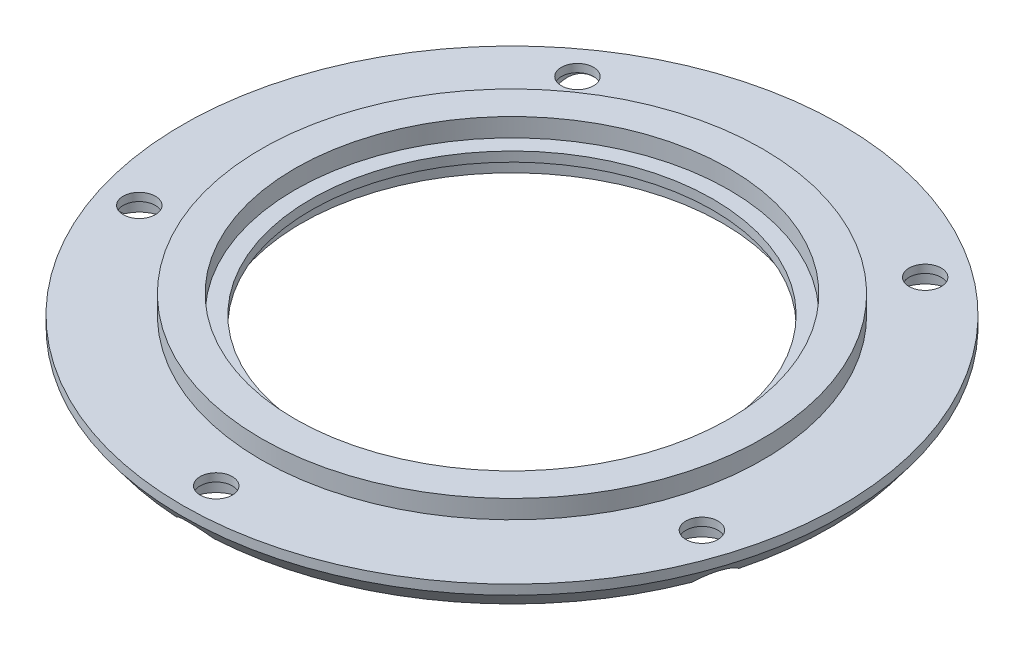
ISO-10303-21;
HEADER;
FILE_DESCRIPTION(('STEP AP214'),'2;1');
FILE_NAME('part.step','',(''),(''),'','','');
FILE_SCHEMA(('AUTOMOTIVE_DESIGN { 1 0 10303 214 1 1 1 1 }'));
ENDSEC;
DATA;
#1=APPLICATION_CONTEXT('core data for automotive mechanical design processes');
#2=APPLICATION_PROTOCOL_DEFINITION('international standard','automotive_design',2000,#1);
#3=PRODUCT_CONTEXT('',#1,'mechanical');
#4=PRODUCT('Part','Part','',(#3));
#5=PRODUCT_RELATED_PRODUCT_CATEGORY('part','',(#4));
#6=PRODUCT_DEFINITION_FORMATION('','',#4);
#7=PRODUCT_DEFINITION_CONTEXT('part definition',#1,'design');
#8=PRODUCT_DEFINITION('design','',#6,#7);
#9=PRODUCT_DEFINITION_SHAPE('','',#8);
#10=(LENGTH_UNIT() NAMED_UNIT(*) SI_UNIT(.MILLI.,.METRE.));
#11=(NAMED_UNIT(*) PLANE_ANGLE_UNIT() SI_UNIT($,.RADIAN.));
#12=(NAMED_UNIT(*) SI_UNIT($,.STERADIAN.) SOLID_ANGLE_UNIT());
#13=UNCERTAINTY_MEASURE_WITH_UNIT(LENGTH_MEASURE(1.E-05),#10,'distance_accuracy_value','');
#14=(GEOMETRIC_REPRESENTATION_CONTEXT(3) GLOBAL_UNCERTAINTY_ASSIGNED_CONTEXT((#13)) GLOBAL_UNIT_ASSIGNED_CONTEXT((#10,
#11,#12)) REPRESENTATION_CONTEXT('',''));
#15=CARTESIAN_POINT('',(0.,0.,0.));
#16=DIRECTION('',(0.,0.,1.));
#17=DIRECTION('',(1.,0.,0.));
#18=AXIS2_PLACEMENT_3D('',#15,#16,#17);
#19=CARTESIAN_POINT('',(-17.4994398998308,-1.6,5.68591269649923));
#20=DIRECTION('',(0.,1.,0.));
#21=DIRECTION('',(0.,0.,1.));
#22=AXIS2_PLACEMENT_3D('',#19,#20,#21);
#23=CYLINDRICAL_SURFACE('',#22,1.);
#24=CARTESIAN_POINT('',(-17.4994398998308,0.,5.68591269649923));
#25=DIRECTION('',(0.,1.,0.));
#26=DIRECTION('',(0.,0.,1.));
#27=AXIS2_PLACEMENT_3D('',#24,#25,#26);
#28=CIRCLE('',#27,1.);
#29=CARTESIAN_POINT('',(-17.4994398998308,0.,6.68591269649923));
#30=VERTEX_POINT('',#29);
#31=EDGE_CURVE('E121',#30,#30,#28,.T.);
#32=ORIENTED_EDGE('',*,*,#31,.T.);
#33=EDGE_LOOP('',(#32));
#34=FACE_BOUND('',#33,.T.);
#35=CARTESIAN_POINT('',(-17.4994398998308,-0.499999999999999,5.68591269649923));
#36=DIRECTION('',(0.,-1.,0.));
#37=DIRECTION('',(0.,0.,-1.));
#38=AXIS2_PLACEMENT_3D('',#35,#36,#37);
#39=CIRCLE('',#38,1.);
#40=CARTESIAN_POINT('',(-17.4994398998308,-0.499999999999999,4.68591269649923));
#41=VERTEX_POINT('',#40);
#42=EDGE_CURVE('E239',#41,#41,#39,.F.);
#43=ORIENTED_EDGE('',*,*,#42,.F.);
#44=EDGE_LOOP('',(#43));
#45=FACE_BOUND('',#44,.T.);
#46=ADVANCED_FACE('F35',(#34,#45),#23,.F.);
#47=CARTESIAN_POINT('',(-10.8152486421816,-1.6,-14.8859126964989));
#48=DIRECTION('',(0.,1.,0.));
#49=DIRECTION('',(0.,0.,1.));
#50=AXIS2_PLACEMENT_3D('',#47,#48,#49);
#51=CYLINDRICAL_SURFACE('',#50,0.999999999999999);
#52=CARTESIAN_POINT('',(-10.8152486421816,0.,-14.8859126964989));
#53=DIRECTION('',(0.,1.,0.));
#54=DIRECTION('',(0.,0.,1.));
#55=AXIS2_PLACEMENT_3D('',#52,#53,#54);
#56=CIRCLE('',#55,0.999999999999999);
#57=CARTESIAN_POINT('',(-10.8152486421816,0.,-13.8859126964989));
#58=VERTEX_POINT('',#57);
#59=EDGE_CURVE('E212',#58,#58,#56,.T.);
#60=ORIENTED_EDGE('',*,*,#59,.T.);
#61=EDGE_LOOP('',(#60));
#62=FACE_BOUND('',#61,.T.);
#63=CARTESIAN_POINT('',(-10.8152486421816,-0.499999999999999,-14.8859126964989));
#64=DIRECTION('',(0.,-1.,0.));
#65=DIRECTION('',(0.,0.,-1.));
#66=AXIS2_PLACEMENT_3D('',#63,#64,#65);
#67=CIRCLE('',#66,0.999999999999999);
#68=CARTESIAN_POINT('',(-10.8152486421816,-0.499999999999999,-15.8859126964989));
#69=VERTEX_POINT('',#68);
#70=EDGE_CURVE('E233',#69,#69,#67,.F.);
#71=ORIENTED_EDGE('',*,*,#70,.F.);
#72=EDGE_LOOP('',(#71));
#73=FACE_BOUND('',#72,.T.);
#74=ADVANCED_FACE('F146',(#62,#73),#51,.F.);
#75=CARTESIAN_POINT('',(10.8152486421814,-1.6,-14.8859126964991));
#76=DIRECTION('',(0.,1.,0.));
#77=DIRECTION('',(0.,0.,1.));
#78=AXIS2_PLACEMENT_3D('',#75,#76,#77);
#79=CYLINDRICAL_SURFACE('',#78,1.);
#80=CARTESIAN_POINT('',(10.8152486421814,0.,-14.8859126964991));
#81=DIRECTION('',(0.,1.,0.));
#82=DIRECTION('',(0.,0.,1.));
#83=AXIS2_PLACEMENT_3D('',#80,#81,#82);
#84=CIRCLE('',#83,1.);
#85=CARTESIAN_POINT('',(10.8152486421814,0.,-13.8859126964991));
#86=VERTEX_POINT('',#85);
#87=EDGE_CURVE('E209',#86,#86,#84,.T.);
#88=ORIENTED_EDGE('',*,*,#87,.T.);
#89=EDGE_LOOP('',(#88));
#90=FACE_BOUND('',#89,.T.);
#91=CARTESIAN_POINT('',(10.8152486421814,-0.499999999999999,-14.8859126964991));
#92=DIRECTION('',(0.,-1.,0.));
#93=DIRECTION('',(0.,0.,-1.));
#94=AXIS2_PLACEMENT_3D('',#91,#92,#93);
#95=CIRCLE('',#94,1.);
#96=CARTESIAN_POINT('',(10.8152486421814,-0.499999999999999,-15.8859126964991));
#97=VERTEX_POINT('',#96);
#98=EDGE_CURVE('E226',#97,#97,#95,.F.);
#99=ORIENTED_EDGE('',*,*,#98,.F.);
#100=EDGE_LOOP('',(#99));
#101=FACE_BOUND('',#100,.T.);
#102=ADVANCED_FACE('F150',(#90,#101),#79,.F.);
#103=CARTESIAN_POINT('',(17.4994398998308,-1.6,5.68591269649898));
#104=DIRECTION('',(0.,1.,0.));
#105=DIRECTION('',(0.,0.,1.));
#106=AXIS2_PLACEMENT_3D('',#103,#104,#105);
#107=CYLINDRICAL_SURFACE('',#106,1.);
#108=CARTESIAN_POINT('',(17.4994398998308,0.,5.68591269649898));
#109=DIRECTION('',(0.,1.,0.));
#110=DIRECTION('',(0.,0.,1.));
#111=AXIS2_PLACEMENT_3D('',#108,#109,#110);
#112=CIRCLE('',#111,1.);
#113=CARTESIAN_POINT('',(17.4994398998308,0.,6.68591269649898));
#114=VERTEX_POINT('',#113);
#115=EDGE_CURVE('E206',#114,#114,#112,.T.);
#116=ORIENTED_EDGE('',*,*,#115,.T.);
#117=EDGE_LOOP('',(#116));
#118=FACE_BOUND('',#117,.T.);
#119=CARTESIAN_POINT('',(17.4994398998308,-0.499999999999999,5.68591269649898));
#120=DIRECTION('',(0.,-1.,0.));
#121=DIRECTION('',(0.,0.,-1.));
#122=AXIS2_PLACEMENT_3D('',#119,#120,#121);
#123=CIRCLE('',#122,1.);
#124=CARTESIAN_POINT('',(17.4994398998308,-0.499999999999999,4.68591269649898));
#125=VERTEX_POINT('',#124);
#126=EDGE_CURVE('E130',#125,#125,#123,.F.);
#127=ORIENTED_EDGE('',*,*,#126,.F.);
#128=EDGE_LOOP('',(#127));
#129=FACE_BOUND('',#128,.T.);
#130=ADVANCED_FACE('F154',(#118,#129),#107,.F.);
#131=CARTESIAN_POINT('',(0.,-1.6,18.4));
#132=DIRECTION('',(0.,1.,0.));
#133=DIRECTION('',(0.,0.,1.));
#134=AXIS2_PLACEMENT_3D('',#131,#132,#133);
#135=CYLINDRICAL_SURFACE('',#134,1.);
#136=CARTESIAN_POINT('',(0.,0.,18.4));
#137=DIRECTION('',(0.,1.,0.));
#138=DIRECTION('',(0.,0.,1.));
#139=AXIS2_PLACEMENT_3D('',#136,#137,#138);
#140=CIRCLE('',#139,1.);
#141=CARTESIAN_POINT('',(0.,0.,19.4));
#142=VERTEX_POINT('',#141);
#143=EDGE_CURVE('E203',#142,#142,#140,.T.);
#144=ORIENTED_EDGE('',*,*,#143,.T.);
#145=EDGE_LOOP('',(#144));
#146=FACE_BOUND('',#145,.T.);
#147=CARTESIAN_POINT('',(0.,-0.499999999999999,18.4));
#148=DIRECTION('',(0.,-1.,0.));
#149=DIRECTION('',(0.,0.,-1.));
#150=AXIS2_PLACEMENT_3D('',#147,#148,#149);
#151=CIRCLE('',#150,1.);
#152=CARTESIAN_POINT('',(0.,-0.499999999999999,17.4));
#153=VERTEX_POINT('',#152);
#154=EDGE_CURVE('E118',#153,#153,#151,.F.);
#155=ORIENTED_EDGE('',*,*,#154,.F.);
#156=EDGE_LOOP('',(#155));
#157=FACE_BOUND('',#156,.T.);
#158=ADVANCED_FACE('F158',(#146,#157),#135,.F.);
#159=CARTESIAN_POINT('',(0.,0.,12.5));
#160=DIRECTION('',(0.,-1.,0.));
#161=DIRECTION('',(0.,0.,-1.));
#162=AXIS2_PLACEMENT_3D('',#159,#160,#161);
#163=PLANE('',#162);
#164=CARTESIAN_POINT('',(0.,0.,0.));
#165=DIRECTION('',(0.,-1.,0.));
#166=DIRECTION('',(0.,0.,-1.));
#167=AXIS2_PLACEMENT_3D('',#164,#165,#166);
#168=CIRCLE('',#167,13.5);
#169=CARTESIAN_POINT('',(0.,0.,-13.5));
#170=VERTEX_POINT('',#169);
#171=EDGE_CURVE('E200',#170,#170,#168,.T.);
#172=ORIENTED_EDGE('',*,*,#171,.F.);
#173=EDGE_LOOP('',(#172));
#174=FACE_BOUND('',#173,.T.);
#175=CARTESIAN_POINT('',(0.,0.,0.));
#176=DIRECTION('',(0.,-1.,0.));
#177=DIRECTION('',(0.,0.,-1.));
#178=AXIS2_PLACEMENT_3D('',#175,#176,#177);
#179=CIRCLE('',#178,12.5);
#180=CARTESIAN_POINT('',(0.,0.,-12.5));
#181=VERTEX_POINT('',#180);
#182=EDGE_CURVE('E114',#181,#181,#179,.T.);
#183=ORIENTED_EDGE('',*,*,#182,.T.);
#184=EDGE_LOOP('',(#183));
#185=FACE_BOUND('',#184,.T.);
#186=ADVANCED_FACE('F37',(#174,#185),#163,.F.);
#187=CARTESIAN_POINT('',(0.,-40.8786396240581,0.));
#188=DIRECTION('',(0.,-1.,0.));
#189=DIRECTION('',(0.,0.,-1.));
#190=AXIS2_PLACEMENT_3D('',#187,#188,#189);
#191=CYLINDRICAL_SURFACE('',#190,12.5);
#192=ORIENTED_EDGE('',*,*,#182,.F.);
#193=EDGE_LOOP('',(#192));
#194=FACE_BOUND('',#193,.T.);
#195=CARTESIAN_POINT('',(0.,-0.599999999999996,0.));
#196=DIRECTION('',(0.,-1.,0.));
#197=DIRECTION('',(0.,0.,-1.));
#198=AXIS2_PLACEMENT_3D('',#195,#196,#197);
#199=CIRCLE('',#198,12.5);
#200=CARTESIAN_POINT('',(0.,-0.599999999999996,-12.5));
#201=VERTEX_POINT('',#200);
#202=EDGE_CURVE('E111',#201,#201,#199,.T.);
#203=ORIENTED_EDGE('',*,*,#202,.T.);
#204=EDGE_LOOP('',(#203));
#205=FACE_BOUND('',#204,.T.);
#206=ADVANCED_FACE('F401',(#194,#205),#191,.F.);
#207=CARTESIAN_POINT('',(0.,-0.599999999999999,13.1));
#208=DIRECTION('',(0.,1.,0.));
#209=DIRECTION('',(0.,0.,1.));
#210=AXIS2_PLACEMENT_3D('',#207,#208,#209);
#211=PLANE('',#210);
#212=ORIENTED_EDGE('',*,*,#202,.F.);
#213=EDGE_LOOP('',(#212));
#214=FACE_BOUND('',#213,.T.);
#215=CARTESIAN_POINT('',(0.,-0.599999999999996,0.));
#216=DIRECTION('',(0.,-1.,0.));
#217=DIRECTION('',(0.,0.,-1.));
#218=AXIS2_PLACEMENT_3D('',#215,#216,#217);
#219=CIRCLE('',#218,13.1);
#220=CARTESIAN_POINT('',(0.,-0.599999999999996,-13.1));
#221=VERTEX_POINT('',#220);
#222=EDGE_CURVE('E108',#221,#221,#219,.T.);
#223=ORIENTED_EDGE('',*,*,#222,.T.);
#224=EDGE_LOOP('',(#223));
#225=FACE_BOUND('',#224,.T.);
#226=ADVANCED_FACE('F391',(#214,#225),#211,.F.);
#227=CARTESIAN_POINT('',(0.,-40.8786396240581,0.));
#228=DIRECTION('',(0.,-1.,0.));
#229=DIRECTION('',(0.,0.,-1.));
#230=AXIS2_PLACEMENT_3D('',#227,#228,#229);
#231=CYLINDRICAL_SURFACE('',#230,13.1);
#232=ORIENTED_EDGE('',*,*,#222,.F.);
#233=EDGE_LOOP('',(#232));
#234=FACE_BOUND('',#233,.T.);
#235=CARTESIAN_POINT('',(0.,-1.6,0.));
#236=DIRECTION('',(0.,-1.,0.));
#237=DIRECTION('',(0.,0.,-1.));
#238=AXIS2_PLACEMENT_3D('',#235,#236,#237);
#239=CIRCLE('',#238,13.1);
#240=CARTESIAN_POINT('',(0.,-1.6,-13.1));
#241=VERTEX_POINT('',#240);
#242=EDGE_CURVE('E99',#241,#241,#239,.T.);
#243=ORIENTED_EDGE('',*,*,#242,.T.);
#244=EDGE_LOOP('',(#243));
#245=FACE_BOUND('',#244,.T.);
#246=ADVANCED_FACE('F373',(#234,#245),#231,.F.);
#247=CARTESIAN_POINT('',(0.,-1.6,19.75));
#248=DIRECTION('',(0.,1.,0.));
#249=DIRECTION('',(0.,0.,1.));
#250=AXIS2_PLACEMENT_3D('',#247,#248,#249);
#251=PLANE('',#250);
#252=ORIENTED_EDGE('',*,*,#242,.F.);
#253=EDGE_LOOP('',(#252));
#254=FACE_BOUND('',#253,.T.);
#255=CARTESIAN_POINT('',(0.,-1.6,0.));
#256=DIRECTION('',(0.,-1.,0.));
#257=DIRECTION('',(0.,0.,-1.));
#258=AXIS2_PLACEMENT_3D('',#255,#256,#257);
#259=CIRCLE('',#258,19.75);
#260=CARTESIAN_POINT('',(-1.15318813031273,-1.6,19.7163043478261));
#261=VERTEX_POINT('',#260);
#262=CARTESIAN_POINT('',(-18.3949649972804,-1.6,7.18942019559509));
#263=VERTEX_POINT('',#262);
#264=EDGE_CURVE('E90',#261,#263,#259,.T.);
#265=ORIENTED_EDGE('',*,*,#264,.T.);
#266=CARTESIAN_POINT('',(-17.4994398998303,-1.6,5.68591269649829));
#267=DIRECTION('',(0.,-1.,0.));
#268=DIRECTION('',(0.,0.,-1.));
#269=AXIS2_PLACEMENT_3D('',#266,#267,#268);
#270=CIRCLE('',#269,1.75000000000094);
#271=CARTESIAN_POINT('',(-19.1076744572369,-1.6,4.99592602389763));
#272=VERTEX_POINT('',#271);
#273=EDGE_CURVE('E54',#272,#263,#270,.T.);
#274=ORIENTED_EDGE('',*,*,#273,.F.);
#275=CARTESIAN_POINT('',(-12.5219017204971,-1.6,-15.272998307543));
#276=VERTEX_POINT('',#275);
#277=EDGE_CURVE('E60',#272,#276,#259,.T.);
#278=ORIENTED_EDGE('',*,*,#277,.T.);
#279=CARTESIAN_POINT('',(-10.8152486421801,-1.6,-14.8859126964995));
#280=DIRECTION('',(0.,-1.,0.));
#281=DIRECTION('',(0.,0.,-1.));
#282=AXIS2_PLACEMENT_3D('',#279,#280,#281);
#283=CIRCLE('',#282,1.75000000000164);
#284=CARTESIAN_POINT('',(-10.6560041302246,-1.6,-16.6286522597785));
#285=VERTEX_POINT('',#284);
#286=EDGE_CURVE('E236',#285,#276,#283,.T.);
#287=ORIENTED_EDGE('',*,*,#286,.F.);
#288=CARTESIAN_POINT('',(10.6560041302267,-1.6,-16.6286522597772));
#289=VERTEX_POINT('',#288);
#290=EDGE_CURVE('E97',#285,#289,#259,.T.);
#291=ORIENTED_EDGE('',*,*,#290,.T.);
#292=CARTESIAN_POINT('',(10.8152486421829,-1.6,-14.8859126964986));
#293=DIRECTION('',(0.,-1.,0.));
#294=DIRECTION('',(0.,0.,-1.));
#295=AXIS2_PLACEMENT_3D('',#292,#293,#294);
#296=CIRCLE('',#295,1.75000000000132);
#297=CARTESIAN_POINT('',(12.5219017204999,-1.6,-15.2729983075407));
#298=VERTEX_POINT('',#297);
#299=EDGE_CURVE('E229',#298,#289,#296,.T.);
#300=ORIENTED_EDGE('',*,*,#299,.F.);
#301=CARTESIAN_POINT('',(19.1076744572368,-1.6,4.99592602389791));
#302=VERTEX_POINT('',#301);
#303=EDGE_CURVE('E101',#298,#302,#259,.T.);
#304=ORIENTED_EDGE('',*,*,#303,.T.);
#305=CARTESIAN_POINT('',(17.4994398998314,-1.6,5.68591269649978));
#306=DIRECTION('',(0.,-1.,0.));
#307=DIRECTION('',(0.,0.,-1.));
#308=AXIS2_PLACEMENT_3D('',#305,#306,#307);
#309=CIRCLE('',#308,1.75000000000035);
#310=CARTESIAN_POINT('',(18.3949649972796,-1.6,7.18942019559699));
#311=VERTEX_POINT('',#310);
#312=EDGE_CURVE('E222',#311,#302,#309,.T.);
#313=ORIENTED_EDGE('',*,*,#312,.F.);
#314=CARTESIAN_POINT('',(1.15318813031273,-1.6,19.7163043478261));
#315=VERTEX_POINT('',#314);
#316=EDGE_CURVE('E100',#311,#315,#259,.T.);
#317=ORIENTED_EDGE('',*,*,#316,.T.);
#318=CARTESIAN_POINT('',(0.,-1.6,18.4));
#319=DIRECTION('',(0.,-1.,0.));
#320=DIRECTION('',(0.,0.,-1.));
#321=AXIS2_PLACEMENT_3D('',#318,#319,#320);
#322=CIRCLE('',#321,1.75);
#323=EDGE_CURVE('E217',#261,#315,#322,.T.);
#324=ORIENTED_EDGE('',*,*,#323,.F.);
#325=EDGE_LOOP('',(#265,#274,#278,#287,#291,#300,#304,#313,#317,#324));
#326=FACE_BOUND('',#325,.T.);
#327=ADVANCED_FACE('F88',(#254,#326),#251,.F.);
#328=CARTESIAN_POINT('',(0.,-0.599999999999996,0.));
#329=DIRECTION('',(0.,1.,0.));
#330=DIRECTION('',(0.,0.,1.));
#331=AXIS2_PLACEMENT_3D('',#328,#329,#330);
#332=CONICAL_SURFACE('',#331,20.5,0.643501108793284);
#333=ORIENTED_EDGE('',*,*,#277,.F.);
#334=CARTESIAN_POINT('',(-19.107578115277,-1.6002,4.9957015114084));
#335=CARTESIAN_POINT('',(-19.1365636923052,-1.54000128969546,5.06329330237877));
#336=CARTESIAN_POINT('',(-19.1623432046582,-1.48220264219676,5.13508596947641));
#337=CARTESIAN_POINT('',(-19.2053259941403,-1.37367107805603,5.28739252826956));
#338=CARTESIAN_POINT('',(-19.222429848212,-1.32302467157268,5.36799519723536));
#339=CARTESIAN_POINT('',(-19.2425788022299,-1.24273863579547,5.51769407886391));
#340=CARTESIAN_POINT('',(-19.2479233929575,-1.21093706629558,5.58529033364524));
#341=CARTESIAN_POINT('',(-19.2503937266641,-1.15573286104441,5.7237771701638));
#342=CARTESIAN_POINT('',(-19.2475498932639,-1.1322994977202,5.79465459710565));
#343=CARTESIAN_POINT('',(-19.2325870674571,-1.09528898712679,5.93890126031064));
#344=CARTESIAN_POINT('',(-19.2203687500943,-1.08182044107502,6.012289087038));
#345=CARTESIAN_POINT('',(-19.1862028695232,-1.06653425965233,6.15805773253485));
#346=CARTESIAN_POINT('',(-19.1642567959591,-1.06471484106959,6.2304387037379));
#347=CARTESIAN_POINT('',(-19.1153832689739,-1.07229848429406,6.36070201241958));
#348=CARTESIAN_POINT('',(-19.089670846923,-1.08008319078523,6.41914647294675));
#349=CARTESIAN_POINT('',(-19.0328405268675,-1.10361011237025,6.531579103256));
#350=CARTESIAN_POINT('',(-19.0017237440659,-1.11935068702888,6.58556818903158));
#351=CARTESIAN_POINT('',(-18.9268774537274,-1.16263267411352,6.70119115434259));
#352=CARTESIAN_POINT('',(-18.8819489715881,-1.1921525154834,6.76130155529781));
#353=CARTESIAN_POINT('',(-18.7876150869865,-1.25987473580657,6.87270105804037));
#354=CARTESIAN_POINT('',(-18.7381933116903,-1.2981097011657,6.92395575002192));
#355=CARTESIAN_POINT('',(-18.6400783730836,-1.37840357591948,7.01467958483102));
#356=CARTESIAN_POINT('',(-18.5915467496434,-1.42005224319126,7.0546983205709));
#357=CARTESIAN_POINT('',(-18.493647730956,-1.50737319625697,7.12733912572517));
#358=CARTESIAN_POINT('',(-18.444292695061,-1.55300339062303,7.16002800094101));
#359=CARTESIAN_POINT('',(-18.3947550898674,-1.6002,7.18954520163113));
#360=B_SPLINE_CURVE_WITH_KNOTS('',3,(#334,#335,#336,#337,#338,#339,#340,#341,#342,#343,#344,
#345,#346,#347,#348,#349,#350,#351,#352,#353,#354,#355,#356,#357,#358,#359),.UNSPECIFIED.,.F.,
.F.,(4,2,2,2,2,2,2,2,2,2,2,2,4),(0.,0.285728652493824,0.574661693444567,0.798486899356478,
1.02148156983626,1.24687211735866,1.47222816197949,1.66428886634107,1.85630998549552,
2.09693024616022,2.33846540517584,2.56429685085106,2.78797782116164),.UNSPECIFIED.);
#361=EDGE_CURVE('E11',#272,#263,#360,.T.);
#362=ORIENTED_EDGE('',*,*,#361,.T.);
#363=ORIENTED_EDGE('',*,*,#264,.F.);
#364=CARTESIAN_POINT('',(-1.15337188307572,-1.6002,19.7161433430027));
#365=CARTESIAN_POINT('',(-1.09804530571879,-1.54000128969549,19.764597277004));
#366=CARTESIAN_POINT('',(-1.03773272927719,-1.48220264219682,19.8113002044189));
#367=CARTESIAN_POINT('',(-0.906162996478146,-1.37367107805615,19.8992445814662));
#368=CARTESIAN_POINT('',(-0.834790684504951,-1.32302467157282,19.9404189078373));
#369=CARTESIAN_POINT('',(-0.698644956860483,-1.24273863579564,20.0058412003146));
#370=CARTESIAN_POINT('',(-0.636008667636403,-1.21093706629577,20.0318125996365));
#371=CARTESIAN_POINT('',(-0.505063234441509,-1.15573286104463,20.076956812587));
#372=CARTESIAN_POINT('',(-0.436776002840429,-1.13229949772043,20.0961544957431));
#373=CARTESIAN_POINT('',(-0.294965506387403,-1.09528898712703,20.1264986730696));
#374=CARTESIAN_POINT('',(-0.221393867853892,-1.08182044107527,20.1375564483625));
#375=CARTESIAN_POINT('',(-0.0722018099584037,-1.06653425965258,20.1501077537159));
#376=CARTESIAN_POINT('',(0.00341829405109275,-1.06471484106984,20.1516027476168));
#377=CARTESIAN_POINT('',(0.142408813020364,-1.07229848429431,20.1453748374294));
#378=CARTESIAN_POINT('',(0.205938373426311,-1.08008319078548,20.1389812024181));
#379=CARTESIAN_POINT('',(0.330429693818976,-1.10361011237048,20.1196759496941));
#380=CARTESIAN_POINT('',(0.391391980350599,-1.11935068702911,20.1067656756599));
#381=CARTESIAN_POINT('',(0.52448473062346,-1.16263267411372,20.071312084734));
#382=CARTESIAN_POINT('',(0.595536783661509,-1.19215251548358,20.0471576944621));
#383=CARTESIAN_POINT('',(0.730634780144068,-1.25987473580671,19.9918651783167));
#384=CARTESIAN_POINT('',(0.794653057402485,-1.29810970116582,19.9607008477382));
#385=CARTESIAN_POINT('',(0.911255735112434,-1.37840357591956,19.8954232027813));
#386=CARTESIAN_POINT('',(0.964312910919347,-1.42005224319133,19.8616333554991));
#387=CARTESIAN_POINT('',(1.06365088251724,-1.50737319625701,19.7909730991153));
#388=CARTESIAN_POINT('',(1.10999139515115,-1.55300339062306,19.7541350885841));
#389=CARTESIAN_POINT('',(1.15337188307572,-1.6002,19.7161433430027));
#390=B_SPLINE_CURVE_WITH_KNOTS('',3,(#364,#365,#366,#367,#368,#369,#370,#371,#372,#373,#374,
#375,#376,#377,#378,#379,#380,#381,#382,#383,#384,#385,#386,#387,#388,#389),.UNSPECIFIED.,.F.,
.F.,(4,2,2,2,2,2,2,2,2,2,2,2,4),(0.,0.285728652493678,0.574661693444272,0.798486899356062,
1.02148156983573,1.246872117358,1.4722281619787,1.66428886634018,1.85630998549453,
2.09693024615909,2.33846540517457,2.5642968508497,2.78797782116019),.UNSPECIFIED.);
#391=EDGE_CURVE('E117',#261,#315,#390,.T.);
#392=ORIENTED_EDGE('',*,*,#391,.T.);
#393=ORIENTED_EDGE('',*,*,#316,.F.);
#394=CARTESIAN_POINT('',(18.3947550898667,-1.6002,7.18954520163303));
#395=CARTESIAN_POINT('',(18.4579343721827,-1.54000128969535,7.15189958876415));
#396=CARTESIAN_POINT('',(18.5209891067258,-1.48220264219655,7.10897091818309));
#397=CARTESIAN_POINT('',(18.6452864629687,-1.37367107805561,7.01101697352466));
#398=CARTESIAN_POINT('',(18.7065008316956,-1.32302467157215,6.95586143772009));
#399=CARTESIAN_POINT('',(18.810792472821,-1.24273863579478,6.84659575646449));
#400=CARTESIAN_POINT('',(18.8548484192183,-1.21093706629484,6.79505070919957));
#401=CARTESIAN_POINT('',(18.938247481311,-1.15573286104358,6.68446453067988));
#402=CARTESIAN_POINT('',(18.977607478038,-1.13229949771931,6.62545192443376));
#403=CARTESIAN_POINT('',(19.0502883590008,-1.09528898712579,6.49995899417724));
#404=CARTESIAN_POINT('',(19.0835398148598,-1.08182044107396,6.43340524842093));
#405=CARTESIAN_POINT('',(19.1415796969198,-1.06653425965116,6.29539373623566));
#406=CARTESIAN_POINT('',(19.1663694178664,-1.06471484106838,6.22393672207634));
#407=CARTESIAN_POINT('',(19.2033967557184,-1.07229848429277,6.08982435321994));
#408=CARTESIAN_POINT('',(19.2169477612887,-1.0800831907839,6.02742840894417));
#409=CARTESIAN_POINT('',(19.2370573085404,-1.10361011236885,5.90306447629004));
#410=CARTESIAN_POINT('',(19.2436172908472,-1.11935068702745,5.84109640235725));
#411=CARTESIAN_POINT('',(19.2510268438336,-1.162632674112,5.70356191283088));
#412=CARTESIAN_POINT('',(19.2500109454424,-1.19215251548182,5.62852327771011));
#413=CARTESIAN_POINT('',(19.2391722144792,-1.25987473580486,5.48295112066629));
#414=CARTESIAN_POINT('',(19.22931591043,-1.29810970116393,5.4124358131506));
#415=CARTESIAN_POINT('',(19.2032653898273,-1.37840357591788,5.28136817505216));
#416=CARTESIAN_POINT('',(19.1875249043828,-1.42005224318995,5.22046616521681));
#417=CARTESIAN_POINT('',(19.1510201285161,-1.50737319625628,5.10415491996279));
#418=CARTESIAN_POINT('',(19.1303051044848,-1.55300339062268,5.04869890216037));
#419=CARTESIAN_POINT('',(19.1075781152769,-1.6002,4.99570151140868));
#420=B_SPLINE_CURVE_WITH_KNOTS('',3,(#394,#395,#396,#397,#398,#399,#400,#401,#402,#403,#404,
#405,#406,#407,#408,#409,#410,#411,#412,#413,#414,#415,#416,#417,#418,#419),.UNSPECIFIED.,.F.,
.F.,(4,2,2,2,2,2,2,2,2,2,2,2,4),(0.,0.285728652494136,0.574661693445203,0.798486899357153,
1.02148156983697,1.24687211735941,1.47222816198028,1.66428886634184,1.85630998549627,
2.09693024616076,2.33846540517616,2.56429685085293,2.78797782116503),.UNSPECIFIED.);
#421=EDGE_CURVE('E129',#311,#302,#420,.T.);
#422=ORIENTED_EDGE('',*,*,#421,.T.);
#423=ORIENTED_EDGE('',*,*,#303,.F.);
#424=CARTESIAN_POINT('',(12.5219557433472,-1.6002,-15.2727600447383));
#425=CARTESIAN_POINT('',(12.5056761098464,-1.54000128969526,-15.3444802470201));
#426=CARTESIAN_POINT('',(12.484333502504,-1.48220264219636,-15.4177145519461));
#427=CARTESIAN_POINT('',(12.4295837605747,-1.37367107805525,-15.5661977961248));
#428=CARTESIAN_POINT('',(12.3960440090746,-1.32302467157171,-15.641460118291));
#429=CARTESIAN_POINT('',(12.324354060388,-1.24273863579423,-15.7744123155885));
#430=CARTESIAN_POINT('',(12.288945843444,-1.21093706629424,-15.832240306072));
#431=CARTESIAN_POINT('',(12.2095438652522,-1.15573286104289,-15.9457305360339));
#432=CARTESIAN_POINT('',(12.1655824494255,-1.13229949771859,-16.0014000156149));
#433=CARTESIAN_POINT('',(12.0686912077397,-1.095288987125,-16.1093030891879));
#434=CARTESIAN_POINT('',(12.0156700991024,-1.08182044107313,-16.161493341437));
#435=CARTESIAN_POINT('',(11.9023486610228,-1.06653425965028,-16.2593404521599));
#436=CARTESIAN_POINT('',(11.8420494471299,-1.06471484106746,-16.3049983095459));
#437=CARTESIAN_POINT('',(11.7259430814659,-1.07229848429182,-16.3816564016236));
#438=CARTESIAN_POINT('',(11.6707885030841,-1.08008319078295,-16.413825580935));
#439=CARTESIAN_POINT('',(11.5587255663912,-1.10361011236787,-16.4713814655659));
#440=CARTESIAN_POINT('',(11.5018175718907,-1.11935068702647,-16.4967695674396));
#441=CARTESIAN_POINT('',(11.3733041772048,-1.16263267411101,-16.5463169656665));
#442=CARTESIAN_POINT('',(11.3016242644318,-1.19215251548082,-16.5685390023687));
#443=CARTESIAN_POINT('',(11.159827563819,-1.25987473580386,-16.6032150270921));
#444=CARTESIAN_POINT('',(11.0897177556547,-1.29810970116293,-16.6156315532855));
#445=CARTESIAN_POINT('',(10.957014970787,-1.37840357591701,-16.6313581634986));
#446=CARTESIAN_POINT('',(10.8942296399753,-1.42005224318924,-16.6352078282776));
#447=CARTESIAN_POINT('',(10.7723304761389,-1.50737319625591,-16.6364318747341));
#448=CARTESIAN_POINT('',(10.7131873745754,-1.55300339062249,-16.6338675680852));
#449=CARTESIAN_POINT('',(10.6557608348579,-1.6002,-16.628630011303));
#450=B_SPLINE_CURVE_WITH_KNOTS('',3,(#424,#425,#426,#427,#428,#429,#430,#431,#432,#433,#434,
#435,#436,#437,#438,#439,#440,#441,#442,#443,#444,#445,#446,#447,#448,#449),.UNSPECIFIED.,.F.,
.F.,(4,2,2,2,2,2,2,2,2,2,2,2,4),(0.,0.285728652494479,0.574661693445891,0.798486899358022,
1.02148156983802,1.24687211736064,1.47222816198169,1.66428886634338,1.85630998549794,
2.0969302461625,2.33846540517799,2.56429685085562,2.78797782116856),.UNSPECIFIED.);
#451=EDGE_CURVE('E254',#298,#289,#450,.T.);
#452=ORIENTED_EDGE('',*,*,#451,.T.);
#453=ORIENTED_EDGE('',*,*,#290,.F.);
#454=CARTESIAN_POINT('',(-10.6557608348559,-1.60019999999999,-16.6286300113044));
#455=CARTESIAN_POINT('',(-10.7290014839999,-1.54000128969533,-16.6353099211256));
#456=CARTESIAN_POINT('',(-10.8052466752892,-1.48220264219651,-16.6376425401312));
#457=CARTESIAN_POINT('',(-10.9633812329197,-1.37367107805554,-16.631456287135));
#458=CARTESIAN_POINT('',(-11.045324308048,-1.32302467157206,-16.6228154245013));
#459=CARTESIAN_POINT('',(-11.1939227741134,-1.24273863579468,-16.5957187200544));
#460=CARTESIAN_POINT('',(-11.2598622020632,-1.21093706629473,-16.5799133364093));
#461=CARTESIAN_POINT('',(-11.3923343854525,-1.15573286104345,-16.539467977397));
#462=CARTESIAN_POINT('',(-11.4588640313541,-1.13229949771917,-16.5148610016679));
#463=CARTESIAN_POINT('',(-11.5914269928909,-1.09528898712565,-16.45605583837));
#464=CARTESIAN_POINT('',(-11.657447296009,-1.08182044107383,-16.421757442385));
#465=CARTESIAN_POINT('',(-11.7855236784562,-1.06653425965104,-16.3442187703273));
#466=CARTESIAN_POINT('',(-11.8475803630836,-1.06471484106826,-16.300979863886));
#467=CARTESIAN_POINT('',(-11.9563653812262,-1.07229848429267,-16.2142448014462));
#468=CARTESIAN_POINT('',(-12.0040037908717,-1.08008319078382,-16.171730503375));
#469=CARTESIAN_POINT('',(-12.0933720418787,-1.10361011236879,-16.0829380636752));
#470=CARTESIAN_POINT('',(-12.1351030990184,-1.11935068702741,-16.0366606996102));
#471=CARTESIAN_POINT('',(-12.2219382979304,-1.162632674112,-15.929748186242));
#472=CARTESIAN_POINT('',(-12.2652230219435,-1.19215251548185,-15.8684435251024));
#473=CARTESIAN_POINT('',(-12.3420194714516,-1.25987473580497,-15.7443023299322));
#474=CARTESIAN_POINT('',(-12.3754934117927,-1.29810970116408,-15.6814608576262));
#475=CARTESIAN_POINT('',(-12.4314577226399,-1.37840357591805,-15.5601127991672));
#476=CARTESIAN_POINT('',(-12.4545207056317,-1.42005224319009,-15.5015900130106));
#477=CARTESIAN_POINT('',(-12.4933537562158,-1.50737319625636,-15.3860352700706));
#478=CARTESIAN_POINT('',(-12.5091911791507,-1.55300339062272,-15.3289944236016));
#479=CARTESIAN_POINT('',(-12.5219557433444,-1.6002,-15.2727600447406));
#480=B_SPLINE_CURVE_WITH_KNOTS('',3,(#454,#455,#456,#457,#458,#459,#460,#461,#462,#463,#464,
#465,#466,#467,#468,#469,#470,#471,#472,#473,#474,#475,#476,#477,#478,#479),.UNSPECIFIED.,.F.,
.F.,(4,2,2,2,2,2,2,2,2,2,2,2,4),(0.,0.285728652494269,0.574661693445466,0.798486899357562,
1.02148156983753,1.24687211736011,1.47222816198113,1.66428886634283,1.8563099854974,
2.0969302461621,2.33846540517771,2.56429685085433,2.78797782116629),.UNSPECIFIED.);
#481=EDGE_CURVE('E48',#285,#276,#480,.T.);
#482=ORIENTED_EDGE('',*,*,#481,.T.);
#483=EDGE_LOOP('',(#333,#362,#363,#392,#393,#422,#423,#452,#453,#482));
#484=FACE_BOUND('',#483,.T.);
#485=CARTESIAN_POINT('',(0.,-0.599999999999996,0.));
#486=DIRECTION('',(0.,-1.,0.));
#487=DIRECTION('',(0.,0.,-1.));
#488=AXIS2_PLACEMENT_3D('',#485,#486,#487);
#489=CIRCLE('',#488,20.5);
#490=CARTESIAN_POINT('',(0.,-0.599999999999996,-20.5));
#491=VERTEX_POINT('',#490);
#492=EDGE_CURVE('E104',#491,#491,#489,.T.);
#493=ORIENTED_EDGE('',*,*,#492,.T.);
#494=EDGE_LOOP('',(#493));
#495=FACE_BOUND('',#494,.T.);
#496=ADVANCED_FACE('F94',(#484,#495),#332,.T.);
#497=CARTESIAN_POINT('',(0.,-40.8786396240581,0.));
#498=DIRECTION('',(0.,-1.,0.));
#499=DIRECTION('',(0.,0.,-1.));
#500=AXIS2_PLACEMENT_3D('',#497,#498,#499);
#501=CYLINDRICAL_SURFACE('',#500,20.5);
#502=ORIENTED_EDGE('',*,*,#492,.F.);
#503=EDGE_LOOP('',(#502));
#504=FACE_BOUND('',#503,.T.);
#505=CARTESIAN_POINT('',(0.,0.,0.));
#506=DIRECTION('',(0.,-1.,0.));
#507=DIRECTION('',(0.,0.,-1.));
#508=AXIS2_PLACEMENT_3D('',#505,#506,#507);
#509=CIRCLE('',#508,20.5);
#510=CARTESIAN_POINT('',(0.,0.,-20.5));
#511=VERTEX_POINT('',#510);
#512=EDGE_CURVE('E188',#511,#511,#509,.T.);
#513=ORIENTED_EDGE('',*,*,#512,.T.);
#514=EDGE_LOOP('',(#513));
#515=FACE_BOUND('',#514,.T.);
#516=ADVANCED_FACE('F176',(#504,#515),#501,.T.);
#517=CARTESIAN_POINT('',(0.,0.,15.6));
#518=DIRECTION('',(0.,-1.,0.));
#519=DIRECTION('',(0.,0.,-1.));
#520=AXIS2_PLACEMENT_3D('',#517,#518,#519);
#521=PLANE('',#520);
#522=ORIENTED_EDGE('',*,*,#31,.F.);
#523=EDGE_LOOP('',(#522));
#524=FACE_BOUND('',#523,.T.);
#525=ORIENTED_EDGE('',*,*,#59,.F.);
#526=EDGE_LOOP('',(#525));
#527=FACE_BOUND('',#526,.T.);
#528=ORIENTED_EDGE('',*,*,#87,.F.);
#529=EDGE_LOOP('',(#528));
#530=FACE_BOUND('',#529,.T.);
#531=ORIENTED_EDGE('',*,*,#115,.F.);
#532=EDGE_LOOP('',(#531));
#533=FACE_BOUND('',#532,.T.);
#534=ORIENTED_EDGE('',*,*,#143,.F.);
#535=EDGE_LOOP('',(#534));
#536=FACE_BOUND('',#535,.T.);
#537=ORIENTED_EDGE('',*,*,#512,.F.);
#538=EDGE_LOOP('',(#537));
#539=FACE_BOUND('',#538,.T.);
#540=CARTESIAN_POINT('',(0.,0.,0.));
#541=DIRECTION('',(0.,-1.,0.));
#542=DIRECTION('',(0.,0.,-1.));
#543=AXIS2_PLACEMENT_3D('',#540,#541,#542);
#544=CIRCLE('',#543,15.6);
#545=CARTESIAN_POINT('',(0.,0.,-15.6));
#546=VERTEX_POINT('',#545);
#547=EDGE_CURVE('E190',#546,#546,#544,.T.);
#548=ORIENTED_EDGE('',*,*,#547,.T.);
#549=EDGE_LOOP('',(#548));
#550=FACE_BOUND('',#549,.T.);
#551=ADVANCED_FACE('F173',(#524,#527,#530,#533,#536,#539,#550),#521,.F.);
#552=CARTESIAN_POINT('',(0.,-40.8786396240581,0.));
#553=DIRECTION('',(0.,-1.,0.));
#554=DIRECTION('',(0.,0.,-1.));
#555=AXIS2_PLACEMENT_3D('',#552,#553,#554);
#556=CYLINDRICAL_SURFACE('',#555,15.6);
#557=ORIENTED_EDGE('',*,*,#547,.F.);
#558=EDGE_LOOP('',(#557));
#559=FACE_BOUND('',#558,.T.);
#560=CARTESIAN_POINT('',(0.,1.15,0.));
#561=DIRECTION('',(0.,-1.,0.));
#562=DIRECTION('',(0.,0.,-1.));
#563=AXIS2_PLACEMENT_3D('',#560,#561,#562);
#564=CIRCLE('',#563,15.6);
#565=CARTESIAN_POINT('',(0.,1.15,-15.6));
#566=VERTEX_POINT('',#565);
#567=EDGE_CURVE('E192',#566,#566,#564,.T.);
#568=ORIENTED_EDGE('',*,*,#567,.T.);
#569=EDGE_LOOP('',(#568));
#570=FACE_BOUND('',#569,.T.);
#571=ADVANCED_FACE('F169',(#559,#570),#556,.T.);
#572=CARTESIAN_POINT('',(0.,1.15,13.5));
#573=DIRECTION('',(0.,-1.,0.));
#574=DIRECTION('',(0.,0.,-1.));
#575=AXIS2_PLACEMENT_3D('',#572,#573,#574);
#576=PLANE('',#575);
#577=ORIENTED_EDGE('',*,*,#567,.F.);
#578=EDGE_LOOP('',(#577));
#579=FACE_BOUND('',#578,.T.);
#580=CARTESIAN_POINT('',(0.,1.15,0.));
#581=DIRECTION('',(0.,-1.,0.));
#582=DIRECTION('',(0.,0.,-1.));
#583=AXIS2_PLACEMENT_3D('',#580,#581,#582);
#584=CIRCLE('',#583,13.5);
#585=CARTESIAN_POINT('',(0.,1.15,-13.5));
#586=VERTEX_POINT('',#585);
#587=EDGE_CURVE('E197',#586,#586,#584,.T.);
#588=ORIENTED_EDGE('',*,*,#587,.T.);
#589=EDGE_LOOP('',(#588));
#590=FACE_BOUND('',#589,.T.);
#591=ADVANCED_FACE('F165',(#579,#590),#576,.F.);
#592=CARTESIAN_POINT('',(0.,-40.8786396240581,0.));
#593=DIRECTION('',(0.,-1.,0.));
#594=DIRECTION('',(0.,0.,-1.));
#595=AXIS2_PLACEMENT_3D('',#592,#593,#594);
#596=CYLINDRICAL_SURFACE('',#595,13.5);
#597=ORIENTED_EDGE('',*,*,#587,.F.);
#598=EDGE_LOOP('',(#597));
#599=FACE_BOUND('',#598,.T.);
#600=ORIENTED_EDGE('',*,*,#171,.T.);
#601=EDGE_LOOP('',(#600));
#602=FACE_BOUND('',#601,.T.);
#603=ADVANCED_FACE('F141',(#599,#602),#596,.F.);
#604=CARTESIAN_POINT('',(0.,-0.499999999999999,18.4));
#605=DIRECTION('',(0.,-1.,0.));
#606=DIRECTION('',(0.,0.,-1.));
#607=AXIS2_PLACEMENT_3D('',#604,#605,#606);
#608=CYLINDRICAL_SURFACE('',#607,1.75);
#609=CARTESIAN_POINT('',(0.,-0.499999999999999,18.4));
#610=DIRECTION('',(0.,-1.,0.));
#611=DIRECTION('',(0.,0.,-1.));
#612=AXIS2_PLACEMENT_3D('',#609,#610,#611);
#613=CIRCLE('',#612,1.75);
#614=CARTESIAN_POINT('',(0.,-0.499999999999999,16.65));
#615=VERTEX_POINT('',#614);
#616=EDGE_CURVE('E122',#615,#615,#613,.T.);
#617=ORIENTED_EDGE('',*,*,#616,.F.);
#618=EDGE_LOOP('',(#617));
#619=FACE_BOUND('',#618,.T.);
#620=ORIENTED_EDGE('',*,*,#323,.T.);
#621=ORIENTED_EDGE('',*,*,#391,.F.);
#622=EDGE_LOOP('',(#620,#621));
#623=FACE_BOUND('',#622,.T.);
#624=ADVANCED_FACE('F135',(#619,#623),#608,.F.);
#625=CARTESIAN_POINT('',(0.,-0.499999999999999,18.4));
#626=DIRECTION('',(0.,-1.,0.));
#627=DIRECTION('',(0.,0.,-1.));
#628=AXIS2_PLACEMENT_3D('',#625,#626,#627);
#629=PLANE('',#628);
#630=ORIENTED_EDGE('',*,*,#616,.T.);
#631=EDGE_LOOP('',(#630));
#632=FACE_BOUND('',#631,.T.);
#633=ORIENTED_EDGE('',*,*,#154,.T.);
#634=EDGE_LOOP('',(#633));
#635=FACE_BOUND('',#634,.T.);
#636=ADVANCED_FACE('F140',(#632,#635),#629,.T.);
#637=CARTESIAN_POINT('',(17.4994398998314,-0.499999999999999,5.68591269649978));
#638=DIRECTION('',(0.,-1.,0.));
#639=DIRECTION('',(0.,0.,-1.));
#640=AXIS2_PLACEMENT_3D('',#637,#638,#639);
#641=CYLINDRICAL_SURFACE('',#640,1.75000000000035);
#642=CARTESIAN_POINT('',(17.4994398998314,-0.499999999999999,5.68591269649978));
#643=DIRECTION('',(0.,-1.,0.));
#644=DIRECTION('',(0.,0.,-1.));
#645=AXIS2_PLACEMENT_3D('',#642,#643,#644);
#646=CIRCLE('',#645,1.75000000000035);
#647=CARTESIAN_POINT('',(17.4994398998314,-0.499999999999999,3.93591269649942));
#648=VERTEX_POINT('',#647);
#649=EDGE_CURVE('E225',#648,#648,#646,.T.);
#650=ORIENTED_EDGE('',*,*,#649,.F.);
#651=EDGE_LOOP('',(#650));
#652=FACE_BOUND('',#651,.T.);
#653=ORIENTED_EDGE('',*,*,#312,.T.);
#654=ORIENTED_EDGE('',*,*,#421,.F.);
#655=EDGE_LOOP('',(#653,#654));
#656=FACE_BOUND('',#655,.T.);
#657=ADVANCED_FACE('F283',(#652,#656),#641,.F.);
#658=CARTESIAN_POINT('',(17.4994398998314,-0.499999999999999,5.68591269649978));
#659=DIRECTION('',(0.,-1.,0.));
#660=DIRECTION('',(0.,0.,-1.));
#661=AXIS2_PLACEMENT_3D('',#658,#659,#660);
#662=PLANE('',#661);
#663=ORIENTED_EDGE('',*,*,#649,.T.);
#664=EDGE_LOOP('',(#663));
#665=FACE_BOUND('',#664,.T.);
#666=ORIENTED_EDGE('',*,*,#126,.T.);
#667=EDGE_LOOP('',(#666));
#668=FACE_BOUND('',#667,.T.);
#669=ADVANCED_FACE('F271',(#665,#668),#662,.T.);
#670=CARTESIAN_POINT('',(10.8152486421829,-0.499999999999999,-14.8859126964986));
#671=DIRECTION('',(0.,-1.,0.));
#672=DIRECTION('',(0.,0.,-1.));
#673=AXIS2_PLACEMENT_3D('',#670,#671,#672);
#674=CYLINDRICAL_SURFACE('',#673,1.75000000000132);
#675=CARTESIAN_POINT('',(10.8152486421829,-0.499999999999999,-14.8859126964986));
#676=DIRECTION('',(0.,-1.,0.));
#677=DIRECTION('',(0.,0.,-1.));
#678=AXIS2_PLACEMENT_3D('',#675,#676,#677);
#679=CIRCLE('',#678,1.75000000000132);
#680=CARTESIAN_POINT('',(10.8152486421829,-0.499999999999999,-16.6359126964999));
#681=VERTEX_POINT('',#680);
#682=EDGE_CURVE('E232',#681,#681,#679,.T.);
#683=ORIENTED_EDGE('',*,*,#682,.F.);
#684=EDGE_LOOP('',(#683));
#685=FACE_BOUND('',#684,.T.);
#686=ORIENTED_EDGE('',*,*,#299,.T.);
#687=ORIENTED_EDGE('',*,*,#451,.F.);
#688=EDGE_LOOP('',(#686,#687));
#689=FACE_BOUND('',#688,.T.);
#690=ADVANCED_FACE('F266',(#685,#689),#674,.F.);
#691=CARTESIAN_POINT('',(10.8152486421829,-0.499999999999999,-14.8859126964986));
#692=DIRECTION('',(0.,-1.,0.));
#693=DIRECTION('',(0.,0.,-1.));
#694=AXIS2_PLACEMENT_3D('',#691,#692,#693);
#695=PLANE('',#694);
#696=ORIENTED_EDGE('',*,*,#682,.T.);
#697=EDGE_LOOP('',(#696));
#698=FACE_BOUND('',#697,.T.);
#699=ORIENTED_EDGE('',*,*,#98,.T.);
#700=EDGE_LOOP('',(#699));
#701=FACE_BOUND('',#700,.T.);
#702=ADVANCED_FACE('F262',(#698,#701),#695,.T.);
#703=CARTESIAN_POINT('',(-10.8152486421801,-0.499999999999999,-14.8859126964995));
#704=DIRECTION('',(0.,-1.,0.));
#705=DIRECTION('',(0.,0.,-1.));
#706=AXIS2_PLACEMENT_3D('',#703,#704,#705);
#707=CYLINDRICAL_SURFACE('',#706,1.75000000000164);
#708=CARTESIAN_POINT('',(-10.8152486421801,-0.499999999999999,-14.8859126964995));
#709=DIRECTION('',(0.,-1.,0.));
#710=DIRECTION('',(0.,0.,-1.));
#711=AXIS2_PLACEMENT_3D('',#708,#709,#710);
#712=CIRCLE('',#711,1.75000000000164);
#713=CARTESIAN_POINT('',(-10.8152486421801,-0.499999999999999,-16.6359126965011));
#714=VERTEX_POINT('',#713);
#715=EDGE_CURVE('E238',#714,#714,#712,.T.);
#716=ORIENTED_EDGE('',*,*,#715,.F.);
#717=EDGE_LOOP('',(#716));
#718=FACE_BOUND('',#717,.T.);
#719=ORIENTED_EDGE('',*,*,#286,.T.);
#720=ORIENTED_EDGE('',*,*,#481,.F.);
#721=EDGE_LOOP('',(#719,#720));
#722=FACE_BOUND('',#721,.T.);
#723=ADVANCED_FACE('F256',(#718,#722),#707,.F.);
#724=CARTESIAN_POINT('',(-10.8152486421801,-0.499999999999999,-14.8859126964995));
#725=DIRECTION('',(0.,-1.,0.));
#726=DIRECTION('',(0.,0.,-1.));
#727=AXIS2_PLACEMENT_3D('',#724,#725,#726);
#728=PLANE('',#727);
#729=ORIENTED_EDGE('',*,*,#715,.T.);
#730=EDGE_LOOP('',(#729));
#731=FACE_BOUND('',#730,.T.);
#732=ORIENTED_EDGE('',*,*,#70,.T.);
#733=EDGE_LOOP('',(#732));
#734=FACE_BOUND('',#733,.T.);
#735=ADVANCED_FACE('F261',(#731,#734),#728,.T.);
#736=CARTESIAN_POINT('',(-17.4994398998303,-0.499999999999999,5.68591269649829));
#737=DIRECTION('',(0.,-1.,0.));
#738=DIRECTION('',(0.,0.,-1.));
#739=AXIS2_PLACEMENT_3D('',#736,#737,#738);
#740=CYLINDRICAL_SURFACE('',#739,1.75000000000094);
#741=CARTESIAN_POINT('',(-17.4994398998303,-0.499999999999999,5.68591269649829));
#742=DIRECTION('',(0.,-1.,0.));
#743=DIRECTION('',(0.,0.,-1.));
#744=AXIS2_PLACEMENT_3D('',#741,#742,#743);
#745=CIRCLE('',#744,1.75000000000094);
#746=CARTESIAN_POINT('',(-17.4994398998303,-0.499999999999999,3.93591269649735));
#747=VERTEX_POINT('',#746);
#748=EDGE_CURVE('E91',#747,#747,#745,.T.);
#749=ORIENTED_EDGE('',*,*,#748,.F.);
#750=EDGE_LOOP('',(#749));
#751=FACE_BOUND('',#750,.T.);
#752=ORIENTED_EDGE('',*,*,#273,.T.);
#753=ORIENTED_EDGE('',*,*,#361,.F.);
#754=EDGE_LOOP('',(#752,#753));
#755=FACE_BOUND('',#754,.T.);
#756=ADVANCED_FACE('F84',(#751,#755),#740,.F.);
#757=CARTESIAN_POINT('',(-17.4994398998303,-0.499999999999999,5.68591269649829));
#758=DIRECTION('',(0.,-1.,0.));
#759=DIRECTION('',(0.,0.,-1.));
#760=AXIS2_PLACEMENT_3D('',#757,#758,#759);
#761=PLANE('',#760);
#762=ORIENTED_EDGE('',*,*,#748,.T.);
#763=EDGE_LOOP('',(#762));
#764=FACE_BOUND('',#763,.T.);
#765=ORIENTED_EDGE('',*,*,#42,.T.);
#766=EDGE_LOOP('',(#765));
#767=FACE_BOUND('',#766,.T.);
#768=ADVANCED_FACE('F478',(#764,#767),#761,.T.);
#769=CLOSED_SHELL('',(#46,#74,#102,#130,#158,#186,#206,#226,#246,#327,#496,#516,#551,#571,#591,
#603,#624,#636,#657,#669,#690,#702,#723,#735,#756,#768));
#770=MANIFOLD_SOLID_BREP('B2',#769);
#771=ADVANCED_BREP_SHAPE_REPRESENTATION('',(#18,#770),#14);
#772=SHAPE_DEFINITION_REPRESENTATION(#9,#771);
ENDSEC;
END-ISO-10303-21;
